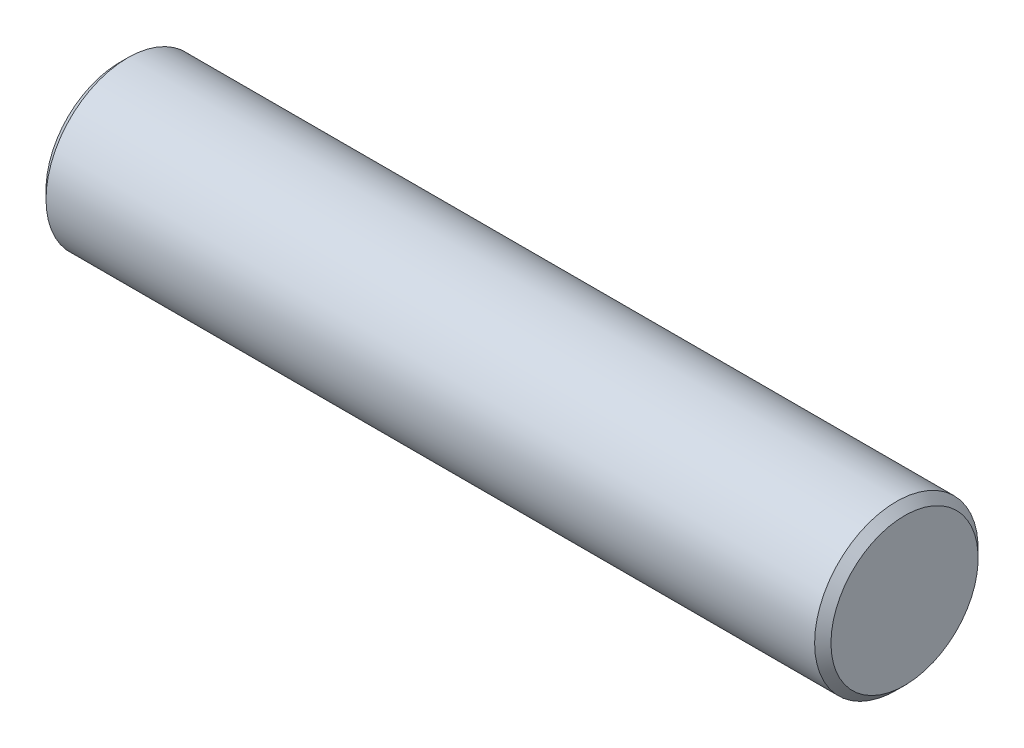
ISO-10303-21;
HEADER;
FILE_DESCRIPTION(('STEP AP214'),'2;1');
FILE_NAME('part.step','',(''),(''),'','','');
FILE_SCHEMA(('AUTOMOTIVE_DESIGN { 1 0 10303 214 1 1 1 1 }'));
ENDSEC;
DATA;
#1=APPLICATION_CONTEXT('core data for automotive mechanical design processes');
#2=APPLICATION_PROTOCOL_DEFINITION('international standard','automotive_design',2000,#1);
#3=PRODUCT_CONTEXT('',#1,'mechanical');
#4=PRODUCT('Part','Part','',(#3));
#5=PRODUCT_RELATED_PRODUCT_CATEGORY('part','',(#4));
#6=PRODUCT_DEFINITION_FORMATION('','',#4);
#7=PRODUCT_DEFINITION_CONTEXT('part definition',#1,'design');
#8=PRODUCT_DEFINITION('design','',#6,#7);
#9=PRODUCT_DEFINITION_SHAPE('','',#8);
#10=(LENGTH_UNIT() NAMED_UNIT(*) SI_UNIT(.MILLI.,.METRE.));
#11=(NAMED_UNIT(*) PLANE_ANGLE_UNIT() SI_UNIT($,.RADIAN.));
#12=(NAMED_UNIT(*) SI_UNIT($,.STERADIAN.) SOLID_ANGLE_UNIT());
#13=UNCERTAINTY_MEASURE_WITH_UNIT(LENGTH_MEASURE(1.E-05),#10,'distance_accuracy_value','');
#14=(GEOMETRIC_REPRESENTATION_CONTEXT(3) GLOBAL_UNCERTAINTY_ASSIGNED_CONTEXT((#13)) GLOBAL_UNIT_ASSIGNED_CONTEXT((#10,
#11,#12)) REPRESENTATION_CONTEXT('',''));
#15=CARTESIAN_POINT('',(0.,0.,0.));
#16=DIRECTION('',(0.,0.,1.));
#17=DIRECTION('',(1.,0.,0.));
#18=AXIS2_PLACEMENT_3D('',#15,#16,#17);
#19=CARTESIAN_POINT('',(0.,0.,0.));
#20=DIRECTION('',(1.,0.,0.));
#21=DIRECTION('',(0.,0.,-1.));
#22=AXIS2_PLACEMENT_3D('',#19,#20,#21);
#23=PLANE('',#22);
#24=CARTESIAN_POINT('',(0.,0.,0.));
#25=DIRECTION('',(1.,0.,0.));
#26=DIRECTION('',(0.,0.,-1.));
#27=AXIS2_PLACEMENT_3D('',#24,#25,#26);
#28=CIRCLE('',#27,2.25);
#29=CARTESIAN_POINT('',(0.,0.,-2.25));
#30=VERTEX_POINT('',#29);
#31=EDGE_CURVE('E48',#30,#30,#28,.F.);
#32=ORIENTED_EDGE('',*,*,#31,.T.);
#33=EDGE_LOOP('',(#32));
#34=FACE_BOUND('',#33,.T.);
#35=ADVANCED_FACE('F33',(#34),#23,.F.);
#36=CARTESIAN_POINT('',(0.,0.,0.));
#37=DIRECTION('',(-1.,0.,0.));
#38=DIRECTION('',(0.,0.,1.));
#39=AXIS2_PLACEMENT_3D('',#36,#37,#38);
#40=CYLINDRICAL_SURFACE('',#39,2.5);
#41=CARTESIAN_POINT('',(0.25,0.,0.));
#42=DIRECTION('',(1.,0.,0.));
#43=DIRECTION('',(0.,0.,-1.));
#44=AXIS2_PLACEMENT_3D('',#41,#42,#43);
#45=CIRCLE('',#44,2.5);
#46=CARTESIAN_POINT('',(0.25,0.,-2.5));
#47=VERTEX_POINT('',#46);
#48=EDGE_CURVE('E40',#47,#47,#45,.T.);
#49=ORIENTED_EDGE('',*,*,#48,.T.);
#50=EDGE_LOOP('',(#49));
#51=FACE_BOUND('',#50,.T.);
#52=CARTESIAN_POINT('',(23.75,0.,0.));
#53=DIRECTION('',(-1.,0.,0.));
#54=DIRECTION('',(0.,0.,1.));
#55=AXIS2_PLACEMENT_3D('',#52,#53,#54);
#56=CIRCLE('',#55,2.5);
#57=CARTESIAN_POINT('',(23.75,0.,2.5));
#58=VERTEX_POINT('',#57);
#59=EDGE_CURVE('E44',#58,#58,#56,.T.);
#60=ORIENTED_EDGE('',*,*,#59,.T.);
#61=EDGE_LOOP('',(#60));
#62=FACE_BOUND('',#61,.T.);
#63=ADVANCED_FACE('F64',(#51,#62),#40,.T.);
#64=CARTESIAN_POINT('',(24.,2.5,0.));
#65=DIRECTION('',(-1.,0.,0.));
#66=DIRECTION('',(0.,0.,1.));
#67=AXIS2_PLACEMENT_3D('',#64,#65,#66);
#68=PLANE('',#67);
#69=CARTESIAN_POINT('',(24.,0.,0.));
#70=DIRECTION('',(-1.,0.,0.));
#71=DIRECTION('',(0.,0.,1.));
#72=AXIS2_PLACEMENT_3D('',#69,#70,#71);
#73=CIRCLE('',#72,2.25);
#74=CARTESIAN_POINT('',(24.,0.,2.25));
#75=VERTEX_POINT('',#74);
#76=EDGE_CURVE('E10',#75,#75,#73,.F.);
#77=ORIENTED_EDGE('',*,*,#76,.T.);
#78=EDGE_LOOP('',(#77));
#79=FACE_BOUND('',#78,.T.);
#80=ADVANCED_FACE('F57',(#79),#68,.F.);
#81=CARTESIAN_POINT('',(0.,0.,0.));
#82=DIRECTION('',(1.,0.,0.));
#83=DIRECTION('',(0.,0.,-1.));
#84=AXIS2_PLACEMENT_3D('',#81,#82,#83);
#85=CONICAL_SURFACE('',#84,2.25,0.785398163397445);
#86=ORIENTED_EDGE('',*,*,#48,.F.);
#87=EDGE_LOOP('',(#86));
#88=FACE_BOUND('',#87,.T.);
#89=ORIENTED_EDGE('',*,*,#31,.F.);
#90=EDGE_LOOP('',(#89));
#91=FACE_BOUND('',#90,.T.);
#92=ADVANCED_FACE('F55',(#88,#91),#85,.T.);
#93=CARTESIAN_POINT('',(23.75,0.,0.));
#94=DIRECTION('',(-1.,0.,0.));
#95=DIRECTION('',(0.,0.,1.));
#96=AXIS2_PLACEMENT_3D('',#93,#94,#95);
#97=CONICAL_SURFACE('',#96,2.5,0.785398163397451);
#98=ORIENTED_EDGE('',*,*,#76,.F.);
#99=EDGE_LOOP('',(#98));
#100=FACE_BOUND('',#99,.T.);
#101=ORIENTED_EDGE('',*,*,#59,.F.);
#102=EDGE_LOOP('',(#101));
#103=FACE_BOUND('',#102,.T.);
#104=ADVANCED_FACE('F35',(#100,#103),#97,.T.);
#105=CLOSED_SHELL('',(#35,#63,#80,#92,#104));
#106=MANIFOLD_SOLID_BREP('B2',#105);
#107=ADVANCED_BREP_SHAPE_REPRESENTATION('',(#18,#106),#14);
#108=SHAPE_DEFINITION_REPRESENTATION(#9,#107);
ENDSEC;
END-ISO-10303-21;
